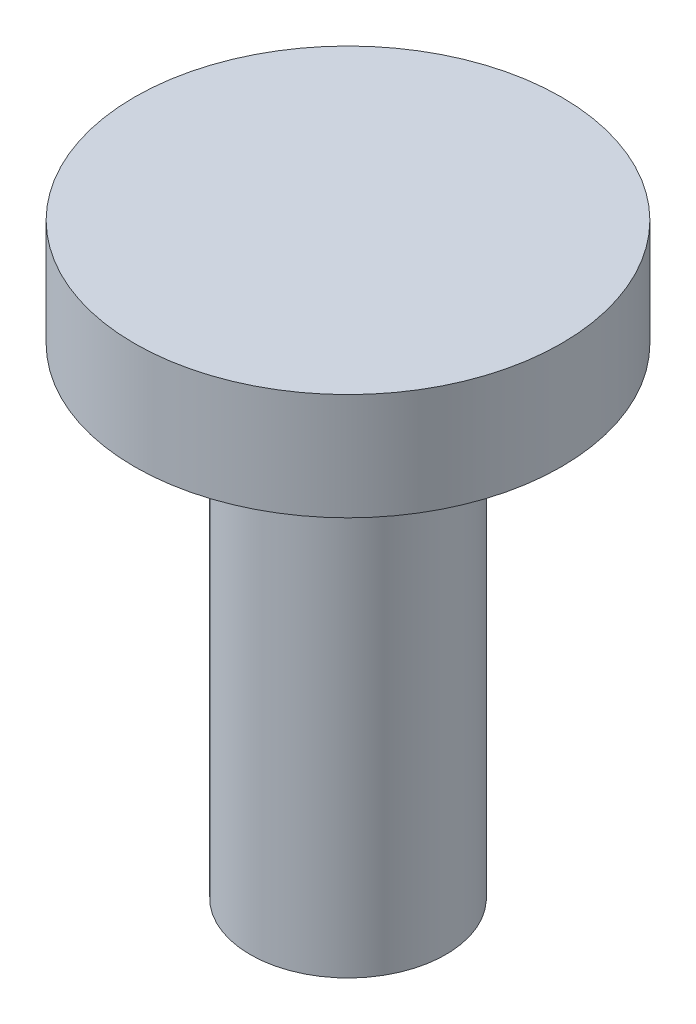
ISO-10303-21;
HEADER;
FILE_DESCRIPTION(('STEP AP214'),'2;1');
FILE_NAME('part.step','',(''),(''),'','','');
FILE_SCHEMA(('AUTOMOTIVE_DESIGN { 1 0 10303 214 1 1 1 1 }'));
ENDSEC;
DATA;
#1=APPLICATION_CONTEXT('core data for automotive mechanical design processes');
#2=APPLICATION_PROTOCOL_DEFINITION('international standard','automotive_design',2000,#1);
#3=PRODUCT_CONTEXT('',#1,'mechanical');
#4=PRODUCT('Part','Part','',(#3));
#5=PRODUCT_RELATED_PRODUCT_CATEGORY('part','',(#4));
#6=PRODUCT_DEFINITION_FORMATION('','',#4);
#7=PRODUCT_DEFINITION_CONTEXT('part definition',#1,'design');
#8=PRODUCT_DEFINITION('design','',#6,#7);
#9=PRODUCT_DEFINITION_SHAPE('','',#8);
#10=(LENGTH_UNIT() NAMED_UNIT(*) SI_UNIT(.MILLI.,.METRE.));
#11=(NAMED_UNIT(*) PLANE_ANGLE_UNIT() SI_UNIT($,.RADIAN.));
#12=(NAMED_UNIT(*) SI_UNIT($,.STERADIAN.) SOLID_ANGLE_UNIT());
#13=UNCERTAINTY_MEASURE_WITH_UNIT(LENGTH_MEASURE(1.E-05),#10,'distance_accuracy_value','');
#14=(GEOMETRIC_REPRESENTATION_CONTEXT(3) GLOBAL_UNCERTAINTY_ASSIGNED_CONTEXT((#13)) GLOBAL_UNIT_ASSIGNED_CONTEXT((#10,
#11,#12)) REPRESENTATION_CONTEXT('',''));
#15=CARTESIAN_POINT('',(0.,0.,0.));
#16=DIRECTION('',(0.,0.,1.));
#17=DIRECTION('',(1.,0.,0.));
#18=AXIS2_PLACEMENT_3D('',#15,#16,#17);
#19=CARTESIAN_POINT('',(0.,32.25,0.));
#20=DIRECTION('',(0.,-1.,0.));
#21=DIRECTION('',(0.,0.,-1.));
#22=AXIS2_PLACEMENT_3D('',#19,#20,#21);
#23=CYLINDRICAL_SURFACE('',#22,6.);
#24=CARTESIAN_POINT('',(0.,32.25,0.));
#25=DIRECTION('',(0.,1.,0.));
#26=DIRECTION('',(0.,0.,1.));
#27=AXIS2_PLACEMENT_3D('',#24,#25,#26);
#28=CIRCLE('',#27,6.);
#29=CARTESIAN_POINT('',(0.,32.25,6.));
#30=VERTEX_POINT('',#29);
#31=EDGE_CURVE('E10',#30,#30,#28,.T.);
#32=ORIENTED_EDGE('',*,*,#31,.F.);
#33=EDGE_LOOP('',(#32));
#34=FACE_BOUND('',#33,.T.);
#35=CARTESIAN_POINT('',(0.,29.25,0.));
#36=DIRECTION('',(0.,1.,0.));
#37=DIRECTION('',(0.,0.,1.));
#38=AXIS2_PLACEMENT_3D('',#35,#36,#37);
#39=CIRCLE('',#38,6.);
#40=CARTESIAN_POINT('',(0.,29.25,6.));
#41=VERTEX_POINT('',#40);
#42=EDGE_CURVE('E37',#41,#41,#39,.T.);
#43=ORIENTED_EDGE('',*,*,#42,.T.);
#44=EDGE_LOOP('',(#43));
#45=FACE_BOUND('',#44,.T.);
#46=ADVANCED_FACE('F33',(#34,#45),#23,.T.);
#47=CARTESIAN_POINT('',(0.,32.25,0.));
#48=DIRECTION('',(0.,1.,0.));
#49=DIRECTION('',(0.,0.,1.));
#50=AXIS2_PLACEMENT_3D('',#47,#48,#49);
#51=PLANE('',#50);
#52=ORIENTED_EDGE('',*,*,#31,.T.);
#53=EDGE_LOOP('',(#52));
#54=FACE_BOUND('',#53,.T.);
#55=ADVANCED_FACE('F61',(#54),#51,.T.);
#56=CARTESIAN_POINT('',(0.,29.25,0.));
#57=DIRECTION('',(0.,1.,0.));
#58=DIRECTION('',(0.,0.,1.));
#59=AXIS2_PLACEMENT_3D('',#56,#57,#58);
#60=PLANE('',#59);
#61=ORIENTED_EDGE('',*,*,#42,.F.);
#62=EDGE_LOOP('',(#61));
#63=FACE_BOUND('',#62,.T.);
#64=CARTESIAN_POINT('',(0.,29.25,0.));
#65=DIRECTION('',(0.,1.,0.));
#66=DIRECTION('',(0.,0.,1.));
#67=AXIS2_PLACEMENT_3D('',#64,#65,#66);
#68=CIRCLE('',#67,2.75);
#69=CARTESIAN_POINT('',(0.,29.25,2.75));
#70=VERTEX_POINT('',#69);
#71=EDGE_CURVE('E44',#70,#70,#68,.F.);
#72=ORIENTED_EDGE('',*,*,#71,.F.);
#73=EDGE_LOOP('',(#72));
#74=FACE_BOUND('',#73,.T.);
#75=ADVANCED_FACE('F56',(#63,#74),#60,.F.);
#76=CARTESIAN_POINT('',(0.,37.7352813742386,0.));
#77=DIRECTION('',(0.,-1.,0.));
#78=DIRECTION('',(0.,0.,-1.));
#79=AXIS2_PLACEMENT_3D('',#76,#77,#78);
#80=CYLINDRICAL_SURFACE('',#79,2.75);
#81=CARTESIAN_POINT('',(0.,15.75,0.));
#82=DIRECTION('',(0.,-1.,0.));
#83=DIRECTION('',(0.,0.,-1.));
#84=AXIS2_PLACEMENT_3D('',#81,#82,#83);
#85=CIRCLE('',#84,2.75);
#86=CARTESIAN_POINT('',(0.,15.75,-2.75));
#87=VERTEX_POINT('',#86);
#88=EDGE_CURVE('E48',#87,#87,#85,.T.);
#89=ORIENTED_EDGE('',*,*,#88,.F.);
#90=EDGE_LOOP('',(#89));
#91=FACE_BOUND('',#90,.T.);
#92=ORIENTED_EDGE('',*,*,#71,.T.);
#93=EDGE_LOOP('',(#92));
#94=FACE_BOUND('',#93,.T.);
#95=ADVANCED_FACE('F53',(#91,#94),#80,.T.);
#96=CARTESIAN_POINT('',(0.,15.75,0.));
#97=DIRECTION('',(0.,1.,0.));
#98=DIRECTION('',(0.,0.,1.));
#99=AXIS2_PLACEMENT_3D('',#96,#97,#98);
#100=PLANE('',#99);
#101=ORIENTED_EDGE('',*,*,#88,.T.);
#102=EDGE_LOOP('',(#101));
#103=FACE_BOUND('',#102,.T.);
#104=ADVANCED_FACE('F35',(#103),#100,.F.);
#105=CLOSED_SHELL('',(#46,#55,#75,#95,#104));
#106=MANIFOLD_SOLID_BREP('B2',#105);
#107=ADVANCED_BREP_SHAPE_REPRESENTATION('',(#18,#106),#14);
#108=SHAPE_DEFINITION_REPRESENTATION(#9,#107);
ENDSEC;
END-ISO-10303-21;
